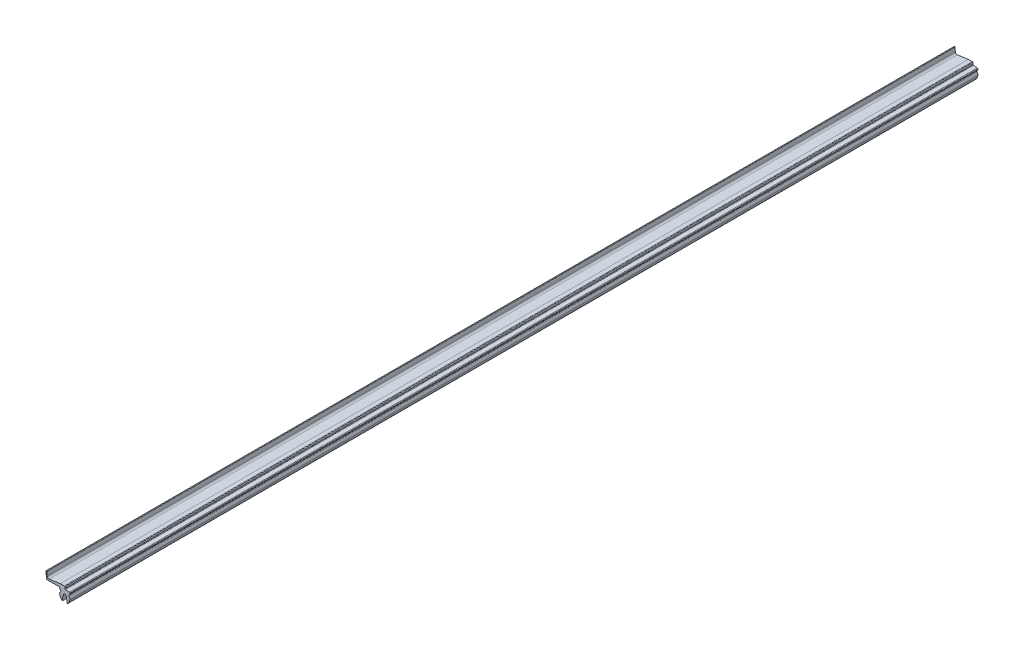
ISO-10303-21;
HEADER;
FILE_DESCRIPTION(('STEP AP214'),'2;1');
FILE_NAME('part.step','',(''),(''),'','','');
FILE_SCHEMA(('AUTOMOTIVE_DESIGN { 1 0 10303 214 1 1 1 1 }'));
ENDSEC;
DATA;
#1=APPLICATION_CONTEXT('core data for automotive mechanical design processes');
#2=APPLICATION_PROTOCOL_DEFINITION('international standard','automotive_design',2000,#1);
#3=PRODUCT_CONTEXT('',#1,'mechanical');
#4=PRODUCT('Part','Part','',(#3));
#5=PRODUCT_RELATED_PRODUCT_CATEGORY('part','',(#4));
#6=PRODUCT_DEFINITION_FORMATION('','',#4);
#7=PRODUCT_DEFINITION_CONTEXT('part definition',#1,'design');
#8=PRODUCT_DEFINITION('design','',#6,#7);
#9=PRODUCT_DEFINITION_SHAPE('','',#8);
#10=(LENGTH_UNIT() NAMED_UNIT(*) SI_UNIT(.MILLI.,.METRE.));
#11=(NAMED_UNIT(*) PLANE_ANGLE_UNIT() SI_UNIT($,.RADIAN.));
#12=(NAMED_UNIT(*) SI_UNIT($,.STERADIAN.) SOLID_ANGLE_UNIT());
#13=UNCERTAINTY_MEASURE_WITH_UNIT(LENGTH_MEASURE(1.E-05),#10,'distance_accuracy_value','');
#14=(GEOMETRIC_REPRESENTATION_CONTEXT(3) GLOBAL_UNCERTAINTY_ASSIGNED_CONTEXT((#13)) GLOBAL_UNIT_ASSIGNED_CONTEXT((#10,
#11,#12)) REPRESENTATION_CONTEXT('',''));
#15=CARTESIAN_POINT('',(0.,0.,0.));
#16=DIRECTION('',(0.,0.,1.));
#17=DIRECTION('',(1.,0.,0.));
#18=AXIS2_PLACEMENT_3D('',#15,#16,#17);
#19=CARTESIAN_POINT('',(-19.5648233753287,0.500000000161028,-1000.));
#20=DIRECTION('',(0.,0.,1.));
#21=DIRECTION('',(1.,0.,0.));
#22=AXIS2_PLACEMENT_3D('',#19,#20,#21);
#23=CYLINDRICAL_SURFACE('',#22,0.500000000160943);
#24=CARTESIAN_POINT('',(-19.5648233753287,0.500000000161028,0.));
#25=DIRECTION('',(0.,0.,1.));
#26=DIRECTION('',(1.,0.,0.));
#27=AXIS2_PLACEMENT_3D('',#24,#25,#26);
#28=CIRCLE('',#27,0.500000000160943);
#29=CARTESIAN_POINT('',(-20.0632733755824,0.460660485573406,0.));
#30=VERTEX_POINT('',#29);
#31=CARTESIAN_POINT('',(-19.5648233753287,0.,0.));
#32=VERTEX_POINT('',#31);
#33=EDGE_CURVE('E250',#30,#32,#28,.T.);
#34=ORIENTED_EDGE('',*,*,#33,.F.);
#35=DIRECTION('',(0.,0.,1.));
#36=VECTOR('',#35,1.);
#37=CARTESIAN_POINT('',(-20.0632733755824,0.460660485573406,-1000.));
#38=LINE('',#37,#36);
#39=CARTESIAN_POINT('',(-20.0632733755824,0.460660485573406,-1000.));
#40=VERTEX_POINT('',#39);
#41=EDGE_CURVE('E11',#40,#30,#38,.T.);
#42=ORIENTED_EDGE('',*,*,#41,.F.);
#43=CARTESIAN_POINT('',(-19.5648233753287,0.500000000161028,-1000.));
#44=DIRECTION('',(0.,0.,1.));
#45=DIRECTION('',(1.,0.,0.));
#46=AXIS2_PLACEMENT_3D('',#43,#44,#45);
#47=CIRCLE('',#46,0.500000000160943);
#48=CARTESIAN_POINT('',(-19.5648233753287,0.,-1000.));
#49=VERTEX_POINT('',#48);
#50=EDGE_CURVE('E350',#40,#49,#47,.T.);
#51=ORIENTED_EDGE('',*,*,#50,.T.);
#52=DIRECTION('',(0.,0.,1.));
#53=VECTOR('',#52,1.);
#54=CARTESIAN_POINT('',(-19.5648233753287,0.,-1000.));
#55=LINE('',#54,#53);
#56=EDGE_CURVE('E42',#49,#32,#55,.T.);
#57=ORIENTED_EDGE('',*,*,#56,.T.);
#58=EDGE_LOOP('',(#34,#42,#51,#57));
#59=FACE_BOUND('',#58,.T.);
#60=ADVANCED_FACE('F39',(#59),#23,.T.);
#61=CARTESIAN_POINT('',(-20.6387893149998,7.75271589489144,-1000.));
#62=DIRECTION('',(-0.996900000186591,-0.0786790291499223,0.));
#63=DIRECTION('',(0.0786790291499223,-0.996900000186591,0.));
#64=AXIS2_PLACEMENT_3D('',#61,#62,#63);
#65=PLANE('',#64);
#66=DIRECTION('',(0.0786790291499223,-0.996900000186591,0.));
#67=VECTOR('',#66,1.);
#68=CARTESIAN_POINT('',(-20.6387893149998,7.75271589489144,0.));
#69=LINE('',#68,#67);
#70=CARTESIAN_POINT('',(-20.6387893149998,7.75271589489144,0.));
#71=VERTEX_POINT('',#70);
#72=EDGE_CURVE('E347',#71,#30,#69,.T.);
#73=ORIENTED_EDGE('',*,*,#72,.F.);
#74=DIRECTION('',(0.,0.,1.));
#75=VECTOR('',#74,1.);
#76=CARTESIAN_POINT('',(-20.6387893149998,7.75271589489144,-1000.));
#77=LINE('',#76,#75);
#78=CARTESIAN_POINT('',(-20.6387893149998,7.75271589489144,-1000.));
#79=VERTEX_POINT('',#78);
#80=EDGE_CURVE('E49',#79,#71,#77,.T.);
#81=ORIENTED_EDGE('',*,*,#80,.F.);
#82=DIRECTION('',(0.0786790291499223,-0.996900000186591,0.));
#83=VECTOR('',#82,1.);
#84=CARTESIAN_POINT('',(-20.6387893149998,7.75271589489144,-1000.));
#85=LINE('',#84,#83);
#86=EDGE_CURVE('E236',#79,#40,#85,.T.);
#87=ORIENTED_EDGE('',*,*,#86,.T.);
#88=ORIENTED_EDGE('',*,*,#41,.T.);
#89=EDGE_LOOP('',(#73,#81,#87,#88));
#90=FACE_BOUND('',#89,.T.);
#91=ADVANCED_FACE('F422',(#90),#65,.T.);
#92=CARTESIAN_POINT('',(-20.1403393147461,7.79205540947906,-1000.));
#93=DIRECTION('',(0.,0.,1.));
#94=DIRECTION('',(1.,0.,0.));
#95=AXIS2_PLACEMENT_3D('',#92,#93,#94);
#96=CYLINDRICAL_SURFACE('',#95,0.500000000160938);
#97=CARTESIAN_POINT('',(-20.1403393147461,7.79205540947906,0.));
#98=DIRECTION('',(0.,0.,1.));
#99=DIRECTION('',(1.,0.,0.));
#100=AXIS2_PLACEMENT_3D('',#97,#98,#99);
#101=CIRCLE('',#100,0.500000000160938);
#102=CARTESIAN_POINT('',(-19.64231318097,7.83643975623623,0.));
#103=VERTEX_POINT('',#102);
#104=EDGE_CURVE('E222',#103,#71,#101,.T.);
#105=ORIENTED_EDGE('',*,*,#104,.F.);
#106=DIRECTION('',(0.,0.,1.));
#107=VECTOR('',#106,1.);
#108=CARTESIAN_POINT('',(-19.64231318097,7.83643975623623,-1000.));
#109=LINE('',#108,#107);
#110=CARTESIAN_POINT('',(-19.64231318097,7.83643975623623,-1000.));
#111=VERTEX_POINT('',#110);
#112=EDGE_CURVE('E217',#111,#103,#109,.T.);
#113=ORIENTED_EDGE('',*,*,#112,.F.);
#114=CARTESIAN_POINT('',(-20.1403393147461,7.79205540947906,-1000.));
#115=DIRECTION('',(0.,0.,1.));
#116=DIRECTION('',(1.,0.,0.));
#117=AXIS2_PLACEMENT_3D('',#114,#115,#116);
#118=CIRCLE('',#117,0.500000000160938);
#119=EDGE_CURVE('E220',#111,#79,#118,.T.);
#120=ORIENTED_EDGE('',*,*,#119,.T.);
#121=ORIENTED_EDGE('',*,*,#80,.T.);
#122=EDGE_LOOP('',(#105,#113,#120,#121));
#123=FACE_BOUND('',#122,.T.);
#124=ADVANCED_FACE('F219',(#123),#96,.T.);
#125=CARTESIAN_POINT('',(-19.266905517935,3.62408020447586,-1000.));
#126=DIRECTION('',(0.996052267231407,0.088768693485785,0.));
#127=DIRECTION('',(-0.088768693485785,0.996052267231407,0.));
#128=AXIS2_PLACEMENT_3D('',#125,#126,#127);
#129=PLANE('',#128);
#130=DIRECTION('',(-0.088768693485785,0.996052267231407,0.));
#131=VECTOR('',#130,1.);
#132=CARTESIAN_POINT('',(-19.266905517935,3.62408020447586,0.));
#133=LINE('',#132,#131);
#134=CARTESIAN_POINT('',(-19.266905517935,3.62408020447586,0.));
#135=VERTEX_POINT('',#134);
#136=EDGE_CURVE('E342',#135,#103,#133,.T.);
#137=ORIENTED_EDGE('',*,*,#136,.F.);
#138=DIRECTION('',(0.,0.,1.));
#139=VECTOR('',#138,1.);
#140=CARTESIAN_POINT('',(-19.266905517935,3.62408020447586,-1000.));
#141=LINE('',#140,#139);
#142=CARTESIAN_POINT('',(-19.266905517935,3.62408020447586,-1000.));
#143=VERTEX_POINT('',#142);
#144=EDGE_CURVE('E228',#143,#135,#141,.T.);
#145=ORIENTED_EDGE('',*,*,#144,.F.);
#146=DIRECTION('',(-0.088768693485785,0.996052267231407,0.));
#147=VECTOR('',#146,1.);
#148=CARTESIAN_POINT('',(-19.266905517935,3.62408020447586,-1000.));
#149=LINE('',#148,#147);
#150=EDGE_CURVE('E234',#143,#111,#149,.T.);
#151=ORIENTED_EDGE('',*,*,#150,.T.);
#152=ORIENTED_EDGE('',*,*,#112,.T.);
#153=EDGE_LOOP('',(#137,#145,#151,#152));
#154=FACE_BOUND('',#153,.T.);
#155=ADVANCED_FACE('F239',(#154),#129,.T.);
#156=CARTESIAN_POINT('',(-17.3266509834356,3.79699669261971,-1000.));
#157=DIRECTION('',(0.,0.,1.));
#158=DIRECTION('',(1.,0.,0.));
#159=AXIS2_PLACEMENT_3D('',#156,#157,#158);
#160=CYLINDRICAL_SURFACE('',#159,1.94794449882878);
#161=CARTESIAN_POINT('',(-17.3266509834356,3.79699669261971,0.));
#162=DIRECTION('',(0.,0.,-1.));
#163=DIRECTION('',(1.,0.,0.));
#164=AXIS2_PLACEMENT_3D('',#161,#162,#163);
#165=CIRCLE('',#164,1.94794449882878);
#166=CARTESIAN_POINT('',(-17.0633866473732,1.86692424323474,0.));
#167=VERTEX_POINT('',#166);
#168=EDGE_CURVE('E338',#167,#135,#165,.T.);
#169=ORIENTED_EDGE('',*,*,#168,.F.);
#170=DIRECTION('',(0.,0.,1.));
#171=VECTOR('',#170,1.);
#172=CARTESIAN_POINT('',(-17.0633866473732,1.86692424323474,-1000.));
#173=LINE('',#172,#171);
#174=CARTESIAN_POINT('',(-17.0633866473732,1.86692424323474,-1000.));
#175=VERTEX_POINT('',#174);
#176=EDGE_CURVE('E356',#175,#167,#173,.T.);
#177=ORIENTED_EDGE('',*,*,#176,.F.);
#178=CARTESIAN_POINT('',(-17.3266509834356,3.79699669261971,-1000.));
#179=DIRECTION('',(0.,0.,-1.));
#180=DIRECTION('',(1.,0.,0.));
#181=AXIS2_PLACEMENT_3D('',#178,#179,#180);
#182=CIRCLE('',#181,1.94794449882878);
#183=EDGE_CURVE('E241',#175,#143,#182,.T.);
#184=ORIENTED_EDGE('',*,*,#183,.T.);
#185=ORIENTED_EDGE('',*,*,#144,.T.);
#186=EDGE_LOOP('',(#169,#177,#184,#185));
#187=FACE_BOUND('',#186,.T.);
#188=ADVANCED_FACE('F435',(#187),#160,.F.);
#189=CARTESIAN_POINT('',(-4.92866087405882,3.52211626725921,-1000.));
#190=DIRECTION('',(-0.135149813673198,0.990825175227245,0.));
#191=DIRECTION('',(-0.990825175227245,-0.135149813673198,0.));
#192=AXIS2_PLACEMENT_3D('',#189,#190,#191);
#193=PLANE('',#192);
#194=DIRECTION('',(-0.990825175227245,-0.135149813673198,0.));
#195=VECTOR('',#194,1.);
#196=CARTESIAN_POINT('',(-4.92866087405882,3.52211626725921,0.));
#197=LINE('',#196,#195);
#198=CARTESIAN_POINT('',(-4.92866087405882,3.52211626725921,0.));
#199=VERTEX_POINT('',#198);
#200=EDGE_CURVE('E334',#199,#167,#197,.T.);
#201=ORIENTED_EDGE('',*,*,#200,.F.);
#202=DIRECTION('',(0.,0.,1.));
#203=VECTOR('',#202,1.);
#204=CARTESIAN_POINT('',(-4.92866087405882,3.52211626725921,-1000.));
#205=LINE('',#204,#203);
#206=CARTESIAN_POINT('',(-4.92866087405882,3.52211626725921,-1000.));
#207=VERTEX_POINT('',#206);
#208=EDGE_CURVE('E359',#207,#199,#205,.T.);
#209=ORIENTED_EDGE('',*,*,#208,.F.);
#210=DIRECTION('',(-0.990825175227245,-0.135149813673198,0.));
#211=VECTOR('',#210,1.);
#212=CARTESIAN_POINT('',(-4.92866087405882,3.52211626725921,-1000.));
#213=LINE('',#212,#211);
#214=EDGE_CURVE('E244',#207,#175,#213,.T.);
#215=ORIENTED_EDGE('',*,*,#214,.T.);
#216=ORIENTED_EDGE('',*,*,#176,.T.);
#217=EDGE_LOOP('',(#201,#209,#215,#216));
#218=FACE_BOUND('',#217,.T.);
#219=ADVANCED_FACE('F438',(#218),#193,.T.);
#220=CARTESIAN_POINT('',(-0.747703742875198,3.52211626725921,-1000.));
#221=DIRECTION('',(0.,1.,0.));
#222=DIRECTION('',(0.,0.,1.));
#223=AXIS2_PLACEMENT_3D('',#220,#221,#222);
#224=PLANE('',#223);
#225=DIRECTION('',(-1.,0.,0.));
#226=VECTOR('',#225,1.);
#227=CARTESIAN_POINT('',(-0.747703742875198,3.52211626725921,0.));
#228=LINE('',#227,#226);
#229=CARTESIAN_POINT('',(-0.747703742875198,3.52211626725921,0.));
#230=VERTEX_POINT('',#229);
#231=EDGE_CURVE('E330',#230,#199,#228,.T.);
#232=ORIENTED_EDGE('',*,*,#231,.F.);
#233=DIRECTION('',(0.,0.,1.));
#234=VECTOR('',#233,1.);
#235=CARTESIAN_POINT('',(-0.747703742875198,3.52211626725921,-1000.));
#236=LINE('',#235,#234);
#237=CARTESIAN_POINT('',(-0.747703742875198,3.52211626725921,-1000.));
#238=VERTEX_POINT('',#237);
#239=EDGE_CURVE('E362',#238,#230,#236,.T.);
#240=ORIENTED_EDGE('',*,*,#239,.F.);
#241=DIRECTION('',(-1.,0.,0.));
#242=VECTOR('',#241,1.);
#243=CARTESIAN_POINT('',(-0.747703742875198,3.52211626725921,-1000.));
#244=LINE('',#243,#242);
#245=EDGE_CURVE('E759',#238,#207,#244,.T.);
#246=ORIENTED_EDGE('',*,*,#245,.T.);
#247=ORIENTED_EDGE('',*,*,#208,.T.);
#248=EDGE_LOOP('',(#232,#240,#246,#247));
#249=FACE_BOUND('',#248,.T.);
#250=ADVANCED_FACE('F442',(#249),#224,.T.);
#251=CARTESIAN_POINT('',(-0.747703742875198,2.51929673228398,-1000.));
#252=DIRECTION('',(0.,0.,1.));
#253=DIRECTION('',(1.,0.,0.));
#254=AXIS2_PLACEMENT_3D('',#251,#252,#253);
#255=CYLINDRICAL_SURFACE('',#254,1.00281953497523);
#256=CARTESIAN_POINT('',(-0.747703742875198,2.51929673228398,0.));
#257=DIRECTION('',(0.,0.,1.));
#258=DIRECTION('',(1.,0.,0.));
#259=AXIS2_PLACEMENT_3D('',#256,#257,#258);
#260=CIRCLE('',#259,1.00281953497523);
#261=CARTESIAN_POINT('',(0.,3.18756773466126,0.));
#262=VERTEX_POINT('',#261);
#263=EDGE_CURVE('E326',#262,#230,#260,.T.);
#264=ORIENTED_EDGE('',*,*,#263,.F.);
#265=DIRECTION('',(0.,0.,1.));
#266=VECTOR('',#265,1.);
#267=CARTESIAN_POINT('',(0.,3.18756773466126,-1000.));
#268=LINE('',#267,#266);
#269=CARTESIAN_POINT('',(0.,3.18756773466126,-1000.));
#270=VERTEX_POINT('',#269);
#271=EDGE_CURVE('E365',#270,#262,#268,.T.);
#272=ORIENTED_EDGE('',*,*,#271,.F.);
#273=CARTESIAN_POINT('',(-0.747703742875198,2.51929673228398,-1000.));
#274=DIRECTION('',(0.,0.,1.));
#275=DIRECTION('',(1.,0.,0.));
#276=AXIS2_PLACEMENT_3D('',#273,#274,#275);
#277=CIRCLE('',#276,1.00281953497523);
#278=EDGE_CURVE('E752',#270,#238,#277,.T.);
#279=ORIENTED_EDGE('',*,*,#278,.T.);
#280=ORIENTED_EDGE('',*,*,#239,.T.);
#281=EDGE_LOOP('',(#264,#272,#279,#280));
#282=FACE_BOUND('',#281,.T.);
#283=ADVANCED_FACE('F446',(#282),#255,.T.);
#284=CARTESIAN_POINT('',(-1.09906525687861,2.20526231237195,-1000.));
#285=DIRECTION('',(0.,0.,1.));
#286=DIRECTION('',(1.,0.,0.));
#287=AXIS2_PLACEMENT_3D('',#284,#285,#286);
#288=CYLINDRICAL_SURFACE('',#287,1.47406525687861);
#289=CARTESIAN_POINT('',(-1.09906525687861,2.20526231237195,0.));
#290=DIRECTION('',(0.,0.,1.));
#291=DIRECTION('',(1.,0.,0.));
#292=AXIS2_PLACEMENT_3D('',#289,#290,#291);
#293=CIRCLE('',#292,1.47406525687861);
#294=CARTESIAN_POINT('',(0.21856094147353,1.54440712176458,0.));
#295=VERTEX_POINT('',#294);
#296=EDGE_CURVE('E322',#295,#262,#293,.T.);
#297=ORIENTED_EDGE('',*,*,#296,.F.);
#298=DIRECTION('',(0.,0.,1.));
#299=VECTOR('',#298,1.);
#300=CARTESIAN_POINT('',(0.21856094147353,1.54440712176458,-1000.));
#301=LINE('',#300,#299);
#302=CARTESIAN_POINT('',(0.21856094147353,1.54440712176458,-1000.));
#303=VERTEX_POINT('',#302);
#304=EDGE_CURVE('E368',#303,#295,#301,.T.);
#305=ORIENTED_EDGE('',*,*,#304,.F.);
#306=CARTESIAN_POINT('',(-1.09906525687861,2.20526231237195,-1000.));
#307=DIRECTION('',(0.,0.,1.));
#308=DIRECTION('',(1.,0.,0.));
#309=AXIS2_PLACEMENT_3D('',#306,#307,#308);
#310=CIRCLE('',#309,1.47406525687861);
#311=EDGE_CURVE('E748',#303,#270,#310,.T.);
#312=ORIENTED_EDGE('',*,*,#311,.T.);
#313=ORIENTED_EDGE('',*,*,#271,.T.);
#314=EDGE_LOOP('',(#297,#305,#312,#313));
#315=FACE_BOUND('',#314,.T.);
#316=ADVANCED_FACE('F450',(#315),#288,.T.);
#317=CARTESIAN_POINT('',(0.718308765862759,1.29375868736384,-1000.));
#318=DIRECTION('',(0.,0.,1.));
#319=DIRECTION('',(1.,0.,0.));
#320=AXIS2_PLACEMENT_3D('',#317,#318,#319);
#321=CYLINDRICAL_SURFACE('',#320,0.559081859524451);
#322=CARTESIAN_POINT('',(0.718308765862759,1.29375868736384,0.));
#323=DIRECTION('',(0.,0.,-1.));
#324=DIRECTION('',(1.,0.,0.));
#325=AXIS2_PLACEMENT_3D('',#322,#323,#324);
#326=CIRCLE('',#325,0.559081859524451);
#327=CARTESIAN_POINT('',(0.673438443794725,0.736480318999495,0.));
#328=VERTEX_POINT('',#327);
#329=EDGE_CURVE('E318',#328,#295,#326,.T.);
#330=ORIENTED_EDGE('',*,*,#329,.F.);
#331=DIRECTION('',(0.,0.,1.));
#332=VECTOR('',#331,1.);
#333=CARTESIAN_POINT('',(0.673438443794725,0.736480318999495,-1000.));
#334=LINE('',#333,#332);
#335=CARTESIAN_POINT('',(0.673438443794725,0.736480318999495,-1000.));
#336=VERTEX_POINT('',#335);
#337=EDGE_CURVE('E371',#336,#328,#334,.T.);
#338=ORIENTED_EDGE('',*,*,#337,.F.);
#339=CARTESIAN_POINT('',(0.718308765862759,1.29375868736384,-1000.));
#340=DIRECTION('',(0.,0.,-1.));
#341=DIRECTION('',(1.,0.,0.));
#342=AXIS2_PLACEMENT_3D('',#339,#340,#341);
#343=CIRCLE('',#342,0.559081859524451);
#344=EDGE_CURVE('E768',#336,#303,#343,.T.);
#345=ORIENTED_EDGE('',*,*,#344,.T.);
#346=ORIENTED_EDGE('',*,*,#304,.T.);
#347=EDGE_LOOP('',(#330,#338,#345,#346));
#348=FACE_BOUND('',#347,.T.);
#349=ADVANCED_FACE('F454',(#348),#321,.F.);
#350=CARTESIAN_POINT('',(5.01765090406748,0.386697834535685,-1000.));
#351=DIRECTION('',(0.0802571596692539,0.996774191239833,0.));
#352=DIRECTION('',(-0.996774191239833,0.0802571596692539,0.));
#353=AXIS2_PLACEMENT_3D('',#350,#351,#352);
#354=PLANE('',#353);
#355=DIRECTION('',(-0.996774191239833,0.0802571596692539,0.));
#356=VECTOR('',#355,1.);
#357=CARTESIAN_POINT('',(5.01765090406748,0.386697834535685,0.));
#358=LINE('',#357,#356);
#359=CARTESIAN_POINT('',(5.01765090406748,0.386697834535685,0.));
#360=VERTEX_POINT('',#359);
#361=EDGE_CURVE('E314',#360,#328,#358,.T.);
#362=ORIENTED_EDGE('',*,*,#361,.F.);
#363=DIRECTION('',(0.,0.,1.));
#364=VECTOR('',#363,1.);
#365=CARTESIAN_POINT('',(5.01765090406748,0.386697834535685,-1000.));
#366=LINE('',#365,#364);
#367=CARTESIAN_POINT('',(5.01765090406748,0.386697834535685,-1000.));
#368=VERTEX_POINT('',#367);
#369=EDGE_CURVE('E374',#368,#360,#366,.T.);
#370=ORIENTED_EDGE('',*,*,#369,.F.);
#371=DIRECTION('',(-0.996774191239833,0.0802571596692539,0.));
#372=VECTOR('',#371,1.);
#373=CARTESIAN_POINT('',(5.01765090406748,0.386697834535685,-1000.));
#374=LINE('',#373,#372);
#375=EDGE_CURVE('E741',#368,#336,#374,.T.);
#376=ORIENTED_EDGE('',*,*,#375,.T.);
#377=ORIENTED_EDGE('',*,*,#337,.T.);
#378=EDGE_LOOP('',(#362,#370,#376,#377));
#379=FACE_BOUND('',#378,.T.);
#380=ADVANCED_FACE('F458',(#379),#354,.T.);
#381=CARTESIAN_POINT('',(4.95980056539854,-0.331789148772958,-1000.));
#382=DIRECTION('',(0.,0.,1.));
#383=DIRECTION('',(1.,0.,0.));
#384=AXIS2_PLACEMENT_3D('',#381,#382,#383);
#385=CYLINDRICAL_SURFACE('',#384,0.72081218557129);
#386=CARTESIAN_POINT('',(4.95980056539854,-0.331789148772958,0.));
#387=DIRECTION('',(0.,0.,1.));
#388=DIRECTION('',(1.,0.,0.));
#389=AXIS2_PLACEMENT_3D('',#386,#387,#388);
#390=CIRCLE('',#389,0.72081218557129);
#391=CARTESIAN_POINT('',(5.67373765869524,-0.43110699048897,0.));
#392=VERTEX_POINT('',#391);
#393=EDGE_CURVE('E310',#392,#360,#390,.T.);
#394=ORIENTED_EDGE('',*,*,#393,.F.);
#395=DIRECTION('',(0.,0.,1.));
#396=VECTOR('',#395,1.);
#397=CARTESIAN_POINT('',(5.67373765869524,-0.43110699048897,-1000.));
#398=LINE('',#397,#396);
#399=CARTESIAN_POINT('',(5.67373765869524,-0.43110699048897,-1000.));
#400=VERTEX_POINT('',#399);
#401=EDGE_CURVE('E377',#400,#392,#398,.T.);
#402=ORIENTED_EDGE('',*,*,#401,.F.);
#403=CARTESIAN_POINT('',(4.95980056539854,-0.331789148772958,-1000.));
#404=DIRECTION('',(0.,0.,1.));
#405=DIRECTION('',(1.,0.,0.));
#406=AXIS2_PLACEMENT_3D('',#403,#404,#405);
#407=CIRCLE('',#406,0.72081218557129);
#408=EDGE_CURVE('E737',#400,#368,#407,.T.);
#409=ORIENTED_EDGE('',*,*,#408,.T.);
#410=ORIENTED_EDGE('',*,*,#369,.T.);
#411=EDGE_LOOP('',(#394,#402,#409,#410));
#412=FACE_BOUND('',#411,.T.);
#413=ADVANCED_FACE('F462',(#412),#385,.T.);
#414=CARTESIAN_POINT('',(1.79930884673125,0.107875941059991,-1000.));
#415=DIRECTION('',(0.,0.,1.));
#416=DIRECTION('',(1.,0.,0.));
#417=AXIS2_PLACEMENT_3D('',#414,#415,#416);
#418=CYLINDRICAL_SURFACE('',#417,3.9117388997066);
#419=CARTESIAN_POINT('',(1.79930884673125,0.107875941059991,0.));
#420=DIRECTION('',(0.,0.,1.));
#421=DIRECTION('',(1.,0.,0.));
#422=AXIS2_PLACEMENT_3D('',#419,#420,#421);
#423=CIRCLE('',#422,3.9117388997066);
#424=CARTESIAN_POINT('',(4.64331942585711,-2.57788373644244,0.));
#425=VERTEX_POINT('',#424);
#426=EDGE_CURVE('E306',#425,#392,#423,.T.);
#427=ORIENTED_EDGE('',*,*,#426,.F.);
#428=DIRECTION('',(0.,0.,1.));
#429=VECTOR('',#428,1.);
#430=CARTESIAN_POINT('',(4.64331942585711,-2.57788373644244,-1000.));
#431=LINE('',#430,#429);
#432=CARTESIAN_POINT('',(4.64331942585711,-2.57788373644244,-1000.));
#433=VERTEX_POINT('',#432);
#434=EDGE_CURVE('E380',#433,#425,#431,.T.);
#435=ORIENTED_EDGE('',*,*,#434,.F.);
#436=CARTESIAN_POINT('',(1.79930884673125,0.107875941059991,-1000.));
#437=DIRECTION('',(0.,0.,1.));
#438=DIRECTION('',(1.,0.,0.));
#439=AXIS2_PLACEMENT_3D('',#436,#437,#438);
#440=CIRCLE('',#439,3.9117388997066);
#441=EDGE_CURVE('E775',#433,#400,#440,.T.);
#442=ORIENTED_EDGE('',*,*,#441,.T.);
#443=ORIENTED_EDGE('',*,*,#401,.T.);
#444=EDGE_LOOP('',(#427,#435,#442,#443));
#445=FACE_BOUND('',#444,.T.);
#446=ADVANCED_FACE('F466',(#445),#418,.T.);
#447=CARTESIAN_POINT('',(5.37462878457498,-3.25992964590054,-1000.));
#448=DIRECTION('',(0.,0.,1.));
#449=DIRECTION('',(1.,0.,0.));
#450=AXIS2_PLACEMENT_3D('',#447,#448,#449);
#451=CYLINDRICAL_SURFACE('',#450,1.00000000037843);
#452=CARTESIAN_POINT('',(5.37462878457498,-3.25992964590054,0.));
#453=DIRECTION('',(0.,0.,-1.));
#454=DIRECTION('',(1.,0.,0.));
#455=AXIS2_PLACEMENT_3D('',#452,#453,#454);
#456=CIRCLE('',#455,1.00000000037843);
#457=CARTESIAN_POINT('',(4.74353623284226,-4.03563718866673,0.));
#458=VERTEX_POINT('',#457);
#459=EDGE_CURVE('E302',#458,#425,#456,.T.);
#460=ORIENTED_EDGE('',*,*,#459,.F.);
#461=DIRECTION('',(0.,0.,1.));
#462=VECTOR('',#461,1.);
#463=CARTESIAN_POINT('',(4.74353623284226,-4.03563718866673,-1000.));
#464=LINE('',#463,#462);
#465=CARTESIAN_POINT('',(4.74353623284226,-4.03563718866673,-1000.));
#466=VERTEX_POINT('',#465);
#467=EDGE_CURVE('E383',#466,#458,#464,.T.);
#468=ORIENTED_EDGE('',*,*,#467,.F.);
#469=CARTESIAN_POINT('',(5.37462878457498,-3.25992964590054,-1000.));
#470=DIRECTION('',(0.,0.,-1.));
#471=DIRECTION('',(1.,0.,0.));
#472=AXIS2_PLACEMENT_3D('',#469,#470,#471);
#473=CIRCLE('',#472,1.00000000037843);
#474=EDGE_CURVE('E730',#466,#433,#473,.T.);
#475=ORIENTED_EDGE('',*,*,#474,.T.);
#476=ORIENTED_EDGE('',*,*,#434,.T.);
#477=EDGE_LOOP('',(#460,#468,#475,#476));
#478=FACE_BOUND('',#477,.T.);
#479=ADVANCED_FACE('F470',(#478),#451,.F.);
#480=CARTESIAN_POINT('',(3.12636068542179,-6.02338885308883,-1000.));
#481=DIRECTION('',(0.,0.,1.));
#482=DIRECTION('',(1.,0.,0.));
#483=AXIS2_PLACEMENT_3D('',#480,#481,#482);
#484=CYLINDRICAL_SURFACE('',#483,2.56250140108987);
#485=CARTESIAN_POINT('',(3.12636068542179,-6.02338885308883,0.));
#486=DIRECTION('',(0.,0.,1.));
#487=DIRECTION('',(1.,0.,0.));
#488=AXIS2_PLACEMENT_3D('',#485,#486,#487);
#489=CIRCLE('',#488,2.56250140108987);
#490=CARTESIAN_POINT('',(5.62475183353854,-6.59299845764218,0.));
#491=VERTEX_POINT('',#490);
#492=EDGE_CURVE('E298',#491,#458,#489,.T.);
#493=ORIENTED_EDGE('',*,*,#492,.F.);
#494=DIRECTION('',(0.,0.,1.));
#495=VECTOR('',#494,1.);
#496=CARTESIAN_POINT('',(5.62475183353854,-6.59299845764218,-1000.));
#497=LINE('',#496,#495);
#498=CARTESIAN_POINT('',(5.62475183353854,-6.59299845764218,-1000.));
#499=VERTEX_POINT('',#498);
#500=EDGE_CURVE('E386',#499,#491,#497,.T.);
#501=ORIENTED_EDGE('',*,*,#500,.F.);
#502=CARTESIAN_POINT('',(3.12636068542179,-6.02338885308883,-1000.));
#503=DIRECTION('',(0.,0.,1.));
#504=DIRECTION('',(1.,0.,0.));
#505=AXIS2_PLACEMENT_3D('',#502,#503,#504);
#506=CIRCLE('',#505,2.56250140108987);
#507=EDGE_CURVE('E726',#499,#466,#506,.T.);
#508=ORIENTED_EDGE('',*,*,#507,.T.);
#509=ORIENTED_EDGE('',*,*,#467,.T.);
#510=EDGE_LOOP('',(#493,#501,#508,#509));
#511=FACE_BOUND('',#510,.T.);
#512=ADVANCED_FACE('F474',(#511),#484,.T.);
#513=CARTESIAN_POINT('',(-5.4704654323828,-4.06339362613339,-1000.));
#514=DIRECTION('',(0.,0.,1.));
#515=DIRECTION('',(1.,0.,0.));
#516=AXIS2_PLACEMENT_3D('',#513,#514,#515);
#517=CYLINDRICAL_SURFACE('',#516,11.3799273627555);
#518=CARTESIAN_POINT('',(-5.4704654323828,-4.06339362613339,0.));
#519=DIRECTION('',(0.,0.,1.));
#520=DIRECTION('',(1.,0.,0.));
#521=AXIS2_PLACEMENT_3D('',#518,#519,#520);
#522=CIRCLE('',#521,11.3799273627555);
#523=CARTESIAN_POINT('',(3.43123270033465,-11.1529999012072,0.));
#524=VERTEX_POINT('',#523);
#525=EDGE_CURVE('E294',#524,#491,#522,.T.);
#526=ORIENTED_EDGE('',*,*,#525,.F.);
#527=DIRECTION('',(0.,0.,1.));
#528=VECTOR('',#527,1.);
#529=CARTESIAN_POINT('',(3.43123270033465,-11.1529999012072,-1000.));
#530=LINE('',#529,#528);
#531=CARTESIAN_POINT('',(3.43123270033465,-11.1529999012072,-1000.));
#532=VERTEX_POINT('',#531);
#533=EDGE_CURVE('E389',#532,#524,#530,.T.);
#534=ORIENTED_EDGE('',*,*,#533,.F.);
#535=CARTESIAN_POINT('',(-5.4704654323828,-4.06339362613339,-1000.));
#536=DIRECTION('',(0.,0.,1.));
#537=DIRECTION('',(1.,0.,0.));
#538=AXIS2_PLACEMENT_3D('',#535,#536,#537);
#539=CIRCLE('',#538,11.3799273627555);
#540=EDGE_CURVE('E782',#532,#499,#539,.T.);
#541=ORIENTED_EDGE('',*,*,#540,.T.);
#542=ORIENTED_EDGE('',*,*,#500,.T.);
#543=EDGE_LOOP('',(#526,#534,#541,#542));
#544=FACE_BOUND('',#543,.T.);
#545=ADVANCED_FACE('F478',(#544),#517,.T.);
#546=CARTESIAN_POINT('',(2.51528712192112,-10.4235106033754,-1000.));
#547=DIRECTION('',(0.,0.,1.));
#548=DIRECTION('',(1.,0.,0.));
#549=AXIS2_PLACEMENT_3D('',#546,#547,#548);
#550=CYLINDRICAL_SURFACE('',#549,1.17094446421101);
#551=CARTESIAN_POINT('',(2.51528712192112,-10.4235106033754,0.));
#552=DIRECTION('',(0.,0.,1.));
#553=DIRECTION('',(1.,0.,0.));
#554=AXIS2_PLACEMENT_3D('',#551,#552,#553);
#555=CIRCLE('',#554,1.17094446421101);
#556=CARTESIAN_POINT('',(2.50692220293999,-11.5944251888157,0.));
#557=VERTEX_POINT('',#556);
#558=EDGE_CURVE('E290',#557,#524,#555,.T.);
#559=ORIENTED_EDGE('',*,*,#558,.F.);
#560=DIRECTION('',(0.,0.,1.));
#561=VECTOR('',#560,1.);
#562=CARTESIAN_POINT('',(2.50692220293999,-11.5944251888157,-1000.));
#563=LINE('',#562,#561);
#564=CARTESIAN_POINT('',(2.50692220293999,-11.5944251888157,-1000.));
#565=VERTEX_POINT('',#564);
#566=EDGE_CURVE('E392',#565,#557,#563,.T.);
#567=ORIENTED_EDGE('',*,*,#566,.F.);
#568=CARTESIAN_POINT('',(2.51528712192112,-10.4235106033754,-1000.));
#569=DIRECTION('',(0.,0.,1.));
#570=DIRECTION('',(1.,0.,0.));
#571=AXIS2_PLACEMENT_3D('',#568,#569,#570);
#572=CIRCLE('',#571,1.17094446421101);
#573=EDGE_CURVE('E719',#565,#532,#572,.T.);
#574=ORIENTED_EDGE('',*,*,#573,.T.);
#575=ORIENTED_EDGE('',*,*,#533,.T.);
#576=EDGE_LOOP('',(#559,#567,#574,#575));
#577=FACE_BOUND('',#576,.T.);
#578=ADVANCED_FACE('F482',(#577),#550,.T.);
#579=CARTESIAN_POINT('',(-18.6308141778548,-11.3809641073458,-1000.));
#580=DIRECTION('',(0.,0.,1.));
#581=DIRECTION('',(1.,0.,0.));
#582=AXIS2_PLACEMENT_3D('',#579,#580,#581);
#583=CYLINDRICAL_SURFACE('',#582,21.1388141800167);
#584=CARTESIAN_POINT('',(-18.6308141778548,-11.3809641073458,0.));
#585=DIRECTION('',(0.,0.,-1.));
#586=DIRECTION('',(1.,0.,0.));
#587=AXIS2_PLACEMENT_3D('',#584,#585,#586);
#588=CIRCLE('',#587,21.1388141800167);
#589=CARTESIAN_POINT('',(1.5838152244622,-5.19887521569609,0.));
#590=VERTEX_POINT('',#589);
#591=EDGE_CURVE('E286',#590,#557,#588,.T.);
#592=ORIENTED_EDGE('',*,*,#591,.F.);
#593=DIRECTION('',(0.,0.,1.));
#594=VECTOR('',#593,1.);
#595=CARTESIAN_POINT('',(1.5838152244622,-5.19887521569609,-1000.));
#596=LINE('',#595,#594);
#597=CARTESIAN_POINT('',(1.5838152244622,-5.19887521569609,-1000.));
#598=VERTEX_POINT('',#597);
#599=EDGE_CURVE('E395',#598,#590,#596,.T.);
#600=ORIENTED_EDGE('',*,*,#599,.F.);
#601=CARTESIAN_POINT('',(-18.6308141778548,-11.3809641073458,-1000.));
#602=DIRECTION('',(0.,0.,-1.));
#603=DIRECTION('',(1.,0.,0.));
#604=AXIS2_PLACEMENT_3D('',#601,#602,#603);
#605=CIRCLE('',#604,21.1388141800167);
#606=EDGE_CURVE('E715',#598,#565,#605,.T.);
#607=ORIENTED_EDGE('',*,*,#606,.T.);
#608=ORIENTED_EDGE('',*,*,#566,.T.);
#609=EDGE_LOOP('',(#592,#600,#607,#608));
#610=FACE_BOUND('',#609,.T.);
#611=ADVANCED_FACE('F486',(#610),#583,.F.);
#612=CARTESIAN_POINT('',(0.,-5.68324157783436,-1000.));
#613=DIRECTION('',(0.,0.,1.));
#614=DIRECTION('',(1.,0.,0.));
#615=AXIS2_PLACEMENT_3D('',#612,#613,#614);
#616=CYLINDRICAL_SURFACE('',#615,1.6562250565697);
#617=CARTESIAN_POINT('',(0.,-5.68324157783436,0.));
#618=DIRECTION('',(0.,0.,-1.));
#619=DIRECTION('',(1.,0.,0.));
#620=AXIS2_PLACEMENT_3D('',#617,#618,#619);
#621=CIRCLE('',#620,1.6562250565697);
#622=CARTESIAN_POINT('',(-1.5838152244622,-5.19887521569609,0.));
#623=VERTEX_POINT('',#622);
#624=EDGE_CURVE('E282',#623,#590,#621,.T.);
#625=ORIENTED_EDGE('',*,*,#624,.F.);
#626=DIRECTION('',(0.,0.,1.));
#627=VECTOR('',#626,1.);
#628=CARTESIAN_POINT('',(-1.5838152244622,-5.19887521569609,-1000.));
#629=LINE('',#628,#627);
#630=CARTESIAN_POINT('',(-1.5838152244622,-5.19887521569609,-1000.));
#631=VERTEX_POINT('',#630);
#632=EDGE_CURVE('E398',#631,#623,#629,.T.);
#633=ORIENTED_EDGE('',*,*,#632,.F.);
#634=CARTESIAN_POINT('',(0.,-5.68324157783436,-1000.));
#635=DIRECTION('',(0.,0.,-1.));
#636=DIRECTION('',(1.,0.,0.));
#637=AXIS2_PLACEMENT_3D('',#634,#635,#636);
#638=CIRCLE('',#637,1.6562250565697);
#639=EDGE_CURVE('E789',#631,#598,#638,.T.);
#640=ORIENTED_EDGE('',*,*,#639,.T.);
#641=ORIENTED_EDGE('',*,*,#599,.T.);
#642=EDGE_LOOP('',(#625,#633,#640,#641));
#643=FACE_BOUND('',#642,.T.);
#644=ADVANCED_FACE('F490',(#643),#616,.F.);
#645=CARTESIAN_POINT('',(18.6308141778548,-11.3809641073458,-1000.));
#646=DIRECTION('',(0.,0.,1.));
#647=DIRECTION('',(1.,0.,0.));
#648=AXIS2_PLACEMENT_3D('',#645,#646,#647);
#649=CYLINDRICAL_SURFACE('',#648,21.1388141800167);
#650=CARTESIAN_POINT('',(18.6308141778548,-11.3809641073458,0.));
#651=DIRECTION('',(0.,0.,-1.));
#652=DIRECTION('',(1.,0.,0.));
#653=AXIS2_PLACEMENT_3D('',#650,#651,#652);
#654=CIRCLE('',#653,21.1388141800167);
#655=CARTESIAN_POINT('',(-2.50692220293999,-11.5944251888157,0.));
#656=VERTEX_POINT('',#655);
#657=EDGE_CURVE('E278',#656,#623,#654,.T.);
#658=ORIENTED_EDGE('',*,*,#657,.F.);
#659=DIRECTION('',(0.,0.,1.));
#660=VECTOR('',#659,1.);
#661=CARTESIAN_POINT('',(-2.50692220293999,-11.5944251888157,-1000.));
#662=LINE('',#661,#660);
#663=CARTESIAN_POINT('',(-2.50692220293999,-11.5944251888157,-1000.));
#664=VERTEX_POINT('',#663);
#665=EDGE_CURVE('E401',#664,#656,#662,.T.);
#666=ORIENTED_EDGE('',*,*,#665,.F.);
#667=CARTESIAN_POINT('',(18.6308141778548,-11.3809641073458,-1000.));
#668=DIRECTION('',(0.,0.,-1.));
#669=DIRECTION('',(1.,0.,0.));
#670=AXIS2_PLACEMENT_3D('',#667,#668,#669);
#671=CIRCLE('',#670,21.1388141800167);
#672=EDGE_CURVE('E708',#664,#631,#671,.T.);
#673=ORIENTED_EDGE('',*,*,#672,.T.);
#674=ORIENTED_EDGE('',*,*,#632,.T.);
#675=EDGE_LOOP('',(#658,#666,#673,#674));
#676=FACE_BOUND('',#675,.T.);
#677=ADVANCED_FACE('F494',(#676),#649,.F.);
#678=CARTESIAN_POINT('',(-2.51528712192112,-10.4235106033754,-1000.));
#679=DIRECTION('',(0.,0.,1.));
#680=DIRECTION('',(1.,0.,0.));
#681=AXIS2_PLACEMENT_3D('',#678,#679,#680);
#682=CYLINDRICAL_SURFACE('',#681,1.17094446421101);
#683=CARTESIAN_POINT('',(-2.51528712192112,-10.4235106033754,0.));
#684=DIRECTION('',(0.,0.,1.));
#685=DIRECTION('',(1.,0.,0.));
#686=AXIS2_PLACEMENT_3D('',#683,#684,#685);
#687=CIRCLE('',#686,1.17094446421101);
#688=CARTESIAN_POINT('',(-3.43123270033465,-11.1529999012072,0.));
#689=VERTEX_POINT('',#688);
#690=EDGE_CURVE('E274',#689,#656,#687,.T.);
#691=ORIENTED_EDGE('',*,*,#690,.F.);
#692=DIRECTION('',(0.,0.,1.));
#693=VECTOR('',#692,1.);
#694=CARTESIAN_POINT('',(-3.43123270033465,-11.1529999012072,-1000.));
#695=LINE('',#694,#693);
#696=CARTESIAN_POINT('',(-3.43123270033465,-11.1529999012072,-1000.));
#697=VERTEX_POINT('',#696);
#698=EDGE_CURVE('E404',#697,#689,#695,.T.);
#699=ORIENTED_EDGE('',*,*,#698,.F.);
#700=CARTESIAN_POINT('',(-2.51528712192112,-10.4235106033754,-1000.));
#701=DIRECTION('',(0.,0.,1.));
#702=DIRECTION('',(1.,0.,0.));
#703=AXIS2_PLACEMENT_3D('',#700,#701,#702);
#704=CIRCLE('',#703,1.17094446421101);
#705=EDGE_CURVE('E704',#697,#664,#704,.T.);
#706=ORIENTED_EDGE('',*,*,#705,.T.);
#707=ORIENTED_EDGE('',*,*,#665,.T.);
#708=EDGE_LOOP('',(#691,#699,#706,#707));
#709=FACE_BOUND('',#708,.T.);
#710=ADVANCED_FACE('F498',(#709),#682,.T.);
#711=CARTESIAN_POINT('',(5.4704654323828,-4.06339362613339,-1000.));
#712=DIRECTION('',(0.,0.,1.));
#713=DIRECTION('',(1.,0.,0.));
#714=AXIS2_PLACEMENT_3D('',#711,#712,#713);
#715=CYLINDRICAL_SURFACE('',#714,11.3799273627555);
#716=CARTESIAN_POINT('',(5.4704654323828,-4.06339362613339,0.));
#717=DIRECTION('',(0.,0.,1.));
#718=DIRECTION('',(1.,0.,0.));
#719=AXIS2_PLACEMENT_3D('',#716,#717,#718);
#720=CIRCLE('',#719,11.3799273627555);
#721=CARTESIAN_POINT('',(-5.62475183353854,-6.59299845764217,0.));
#722=VERTEX_POINT('',#721);
#723=EDGE_CURVE('E270',#722,#689,#720,.T.);
#724=ORIENTED_EDGE('',*,*,#723,.F.);
#725=DIRECTION('',(0.,0.,1.));
#726=VECTOR('',#725,1.);
#727=CARTESIAN_POINT('',(-5.62475183353854,-6.59299845764217,-1000.));
#728=LINE('',#727,#726);
#729=CARTESIAN_POINT('',(-5.62475183353854,-6.59299845764217,-1000.));
#730=VERTEX_POINT('',#729);
#731=EDGE_CURVE('E407',#730,#722,#728,.T.);
#732=ORIENTED_EDGE('',*,*,#731,.F.);
#733=CARTESIAN_POINT('',(5.4704654323828,-4.06339362613339,-1000.));
#734=DIRECTION('',(0.,0.,1.));
#735=DIRECTION('',(1.,0.,0.));
#736=AXIS2_PLACEMENT_3D('',#733,#734,#735);
#737=CIRCLE('',#736,11.3799273627555);
#738=EDGE_CURVE('E796',#730,#697,#737,.T.);
#739=ORIENTED_EDGE('',*,*,#738,.T.);
#740=ORIENTED_EDGE('',*,*,#698,.T.);
#741=EDGE_LOOP('',(#724,#732,#739,#740));
#742=FACE_BOUND('',#741,.T.);
#743=ADVANCED_FACE('F502',(#742),#715,.T.);
#744=CARTESIAN_POINT('',(-3.12636068542179,-6.02338885308883,-1000.));
#745=DIRECTION('',(0.,0.,1.));
#746=DIRECTION('',(1.,0.,0.));
#747=AXIS2_PLACEMENT_3D('',#744,#745,#746);
#748=CYLINDRICAL_SURFACE('',#747,2.56250140108987);
#749=CARTESIAN_POINT('',(-3.12636068542179,-6.02338885308883,0.));
#750=DIRECTION('',(0.,0.,1.));
#751=DIRECTION('',(1.,0.,0.));
#752=AXIS2_PLACEMENT_3D('',#749,#750,#751);
#753=CIRCLE('',#752,2.56250140108987);
#754=CARTESIAN_POINT('',(-4.74353623284226,-4.03563718866672,0.));
#755=VERTEX_POINT('',#754);
#756=EDGE_CURVE('E266',#755,#722,#753,.T.);
#757=ORIENTED_EDGE('',*,*,#756,.F.);
#758=DIRECTION('',(0.,0.,1.));
#759=VECTOR('',#758,1.);
#760=CARTESIAN_POINT('',(-4.74353623284226,-4.03563718866672,-1000.));
#761=LINE('',#760,#759);
#762=CARTESIAN_POINT('',(-4.74353623284226,-4.03563718866672,-1000.));
#763=VERTEX_POINT('',#762);
#764=EDGE_CURVE('E410',#763,#755,#761,.T.);
#765=ORIENTED_EDGE('',*,*,#764,.F.);
#766=CARTESIAN_POINT('',(-3.12636068542179,-6.02338885308883,-1000.));
#767=DIRECTION('',(0.,0.,1.));
#768=DIRECTION('',(1.,0.,0.));
#769=AXIS2_PLACEMENT_3D('',#766,#767,#768);
#770=CIRCLE('',#769,2.56250140108987);
#771=EDGE_CURVE('E697',#763,#730,#770,.T.);
#772=ORIENTED_EDGE('',*,*,#771,.T.);
#773=ORIENTED_EDGE('',*,*,#731,.T.);
#774=EDGE_LOOP('',(#757,#765,#772,#773));
#775=FACE_BOUND('',#774,.T.);
#776=ADVANCED_FACE('F506',(#775),#748,.T.);
#777=CARTESIAN_POINT('',(-5.37462878457497,-3.25992964590054,-1000.));
#778=DIRECTION('',(0.,0.,1.));
#779=DIRECTION('',(1.,0.,0.));
#780=AXIS2_PLACEMENT_3D('',#777,#778,#779);
#781=CYLINDRICAL_SURFACE('',#780,1.00000000037843);
#782=CARTESIAN_POINT('',(-5.37462878457497,-3.25992964590054,0.));
#783=DIRECTION('',(0.,0.,-1.));
#784=DIRECTION('',(1.,0.,0.));
#785=AXIS2_PLACEMENT_3D('',#782,#783,#784);
#786=CIRCLE('',#785,1.00000000037843);
#787=CARTESIAN_POINT('',(-4.64331942585814,-2.57788373644134,0.));
#788=VERTEX_POINT('',#787);
#789=EDGE_CURVE('E262',#788,#755,#786,.T.);
#790=ORIENTED_EDGE('',*,*,#789,.F.);
#791=DIRECTION('',(0.,0.,1.));
#792=VECTOR('',#791,1.);
#793=CARTESIAN_POINT('',(-4.64331942585814,-2.57788373644134,-1000.));
#794=LINE('',#793,#792);
#795=CARTESIAN_POINT('',(-4.64331942585814,-2.57788373644134,-1000.));
#796=VERTEX_POINT('',#795);
#797=EDGE_CURVE('E413',#796,#788,#794,.T.);
#798=ORIENTED_EDGE('',*,*,#797,.F.);
#799=CARTESIAN_POINT('',(-5.37462878457497,-3.25992964590054,-1000.));
#800=DIRECTION('',(0.,0.,-1.));
#801=DIRECTION('',(1.,0.,0.));
#802=AXIS2_PLACEMENT_3D('',#799,#800,#801);
#803=CIRCLE('',#802,1.00000000037843);
#804=EDGE_CURVE('E693',#796,#763,#803,.T.);
#805=ORIENTED_EDGE('',*,*,#804,.T.);
#806=ORIENTED_EDGE('',*,*,#764,.T.);
#807=EDGE_LOOP('',(#790,#798,#805,#806));
#808=FACE_BOUND('',#807,.T.);
#809=ADVANCED_FACE('F510',(#808),#781,.F.);
#810=CARTESIAN_POINT('',(-1.79930884673125,0.107875941059991,-1000.));
#811=DIRECTION('',(0.,0.,1.));
#812=DIRECTION('',(1.,0.,0.));
#813=AXIS2_PLACEMENT_3D('',#810,#811,#812);
#814=CYLINDRICAL_SURFACE('',#813,3.91173889970659);
#815=CARTESIAN_POINT('',(-1.79930884673125,0.107875941059991,0.));
#816=DIRECTION('',(0.,0.,1.));
#817=DIRECTION('',(1.,0.,0.));
#818=AXIS2_PLACEMENT_3D('',#815,#816,#817);
#819=CIRCLE('',#818,3.91173889970659);
#820=CARTESIAN_POINT('',(-5.70955998966544,0.,0.));
#821=VERTEX_POINT('',#820);
#822=EDGE_CURVE('E258',#821,#788,#819,.T.);
#823=ORIENTED_EDGE('',*,*,#822,.F.);
#824=DIRECTION('',(0.,0.,1.));
#825=VECTOR('',#824,1.);
#826=CARTESIAN_POINT('',(-5.70955998966544,0.,-1000.));
#827=LINE('',#826,#825);
#828=CARTESIAN_POINT('',(-5.70955998966544,0.,-1000.));
#829=VERTEX_POINT('',#828);
#830=EDGE_CURVE('E415',#829,#821,#827,.T.);
#831=ORIENTED_EDGE('',*,*,#830,.F.);
#832=CARTESIAN_POINT('',(-1.79930884673125,0.107875941059991,-1000.));
#833=DIRECTION('',(0.,0.,1.));
#834=DIRECTION('',(1.,0.,0.));
#835=AXIS2_PLACEMENT_3D('',#832,#833,#834);
#836=CIRCLE('',#835,3.91173889970659);
#837=EDGE_CURVE('E803',#829,#796,#836,.T.);
#838=ORIENTED_EDGE('',*,*,#837,.T.);
#839=ORIENTED_EDGE('',*,*,#797,.T.);
#840=EDGE_LOOP('',(#823,#831,#838,#839));
#841=FACE_BOUND('',#840,.T.);
#842=ADVANCED_FACE('F514',(#841),#814,.T.);
#843=CARTESIAN_POINT('',(-19.5648233753287,0.,-1000.));
#844=DIRECTION('',(0.,-1.,0.));
#845=DIRECTION('',(1.,0.,0.));
#846=AXIS2_PLACEMENT_3D('',#843,#844,#845);
#847=PLANE('',#846);
#848=DIRECTION('',(1.,0.,0.));
#849=VECTOR('',#848,1.);
#850=CARTESIAN_POINT('',(-19.5648233753287,0.,0.));
#851=LINE('',#850,#849);
#852=EDGE_CURVE('E254',#32,#821,#851,.T.);
#853=ORIENTED_EDGE('',*,*,#852,.F.);
#854=ORIENTED_EDGE('',*,*,#56,.F.);
#855=DIRECTION('',(1.,0.,0.));
#856=VECTOR('',#855,1.);
#857=CARTESIAN_POINT('',(-19.5648233753287,0.,-1000.));
#858=LINE('',#857,#856);
#859=EDGE_CURVE('E806',#49,#829,#858,.T.);
#860=ORIENTED_EDGE('',*,*,#859,.T.);
#861=ORIENTED_EDGE('',*,*,#830,.T.);
#862=EDGE_LOOP('',(#853,#854,#860,#861));
#863=FACE_BOUND('',#862,.T.);
#864=ADVANCED_FACE('F419',(#863),#847,.T.);
#865=CARTESIAN_POINT('',(-19.5648233753287,0.500000000161028,-1000.));
#866=DIRECTION('',(0.,0.,1.));
#867=DIRECTION('',(1.,0.,0.));
#868=AXIS2_PLACEMENT_3D('',#865,#866,#867);
#869=PLANE('',#868);
#870=ORIENTED_EDGE('',*,*,#50,.F.);
#871=ORIENTED_EDGE('',*,*,#86,.F.);
#872=ORIENTED_EDGE('',*,*,#119,.F.);
#873=ORIENTED_EDGE('',*,*,#150,.F.);
#874=ORIENTED_EDGE('',*,*,#183,.F.);
#875=ORIENTED_EDGE('',*,*,#214,.F.);
#876=ORIENTED_EDGE('',*,*,#245,.F.);
#877=ORIENTED_EDGE('',*,*,#278,.F.);
#878=ORIENTED_EDGE('',*,*,#311,.F.);
#879=ORIENTED_EDGE('',*,*,#344,.F.);
#880=ORIENTED_EDGE('',*,*,#375,.F.);
#881=ORIENTED_EDGE('',*,*,#408,.F.);
#882=ORIENTED_EDGE('',*,*,#441,.F.);
#883=ORIENTED_EDGE('',*,*,#474,.F.);
#884=ORIENTED_EDGE('',*,*,#507,.F.);
#885=ORIENTED_EDGE('',*,*,#540,.F.);
#886=ORIENTED_EDGE('',*,*,#573,.F.);
#887=ORIENTED_EDGE('',*,*,#606,.F.);
#888=ORIENTED_EDGE('',*,*,#639,.F.);
#889=ORIENTED_EDGE('',*,*,#672,.F.);
#890=ORIENTED_EDGE('',*,*,#705,.F.);
#891=ORIENTED_EDGE('',*,*,#738,.F.);
#892=ORIENTED_EDGE('',*,*,#771,.F.);
#893=ORIENTED_EDGE('',*,*,#804,.F.);
#894=ORIENTED_EDGE('',*,*,#837,.F.);
#895=ORIENTED_EDGE('',*,*,#859,.F.);
#896=EDGE_LOOP('',(#870,#871,#872,#873,#874,#875,#876,#877,#878,#879,#880,#881,#882,#883,#884,
#885,#886,#887,#888,#889,#890,#891,#892,#893,#894,#895));
#897=FACE_BOUND('',#896,.T.);
#898=ADVANCED_FACE('F232',(#897),#869,.F.);
#899=CARTESIAN_POINT('',(-19.5648233753287,0.500000000161028,0.));
#900=DIRECTION('',(0.,0.,1.));
#901=DIRECTION('',(1.,0.,0.));
#902=AXIS2_PLACEMENT_3D('',#899,#900,#901);
#903=PLANE('',#902);
#904=ORIENTED_EDGE('',*,*,#33,.T.);
#905=ORIENTED_EDGE('',*,*,#852,.T.);
#906=ORIENTED_EDGE('',*,*,#822,.T.);
#907=ORIENTED_EDGE('',*,*,#789,.T.);
#908=ORIENTED_EDGE('',*,*,#756,.T.);
#909=ORIENTED_EDGE('',*,*,#723,.T.);
#910=ORIENTED_EDGE('',*,*,#690,.T.);
#911=ORIENTED_EDGE('',*,*,#657,.T.);
#912=ORIENTED_EDGE('',*,*,#624,.T.);
#913=ORIENTED_EDGE('',*,*,#591,.T.);
#914=ORIENTED_EDGE('',*,*,#558,.T.);
#915=ORIENTED_EDGE('',*,*,#525,.T.);
#916=ORIENTED_EDGE('',*,*,#492,.T.);
#917=ORIENTED_EDGE('',*,*,#459,.T.);
#918=ORIENTED_EDGE('',*,*,#426,.T.);
#919=ORIENTED_EDGE('',*,*,#393,.T.);
#920=ORIENTED_EDGE('',*,*,#361,.T.);
#921=ORIENTED_EDGE('',*,*,#329,.T.);
#922=ORIENTED_EDGE('',*,*,#296,.T.);
#923=ORIENTED_EDGE('',*,*,#263,.T.);
#924=ORIENTED_EDGE('',*,*,#231,.T.);
#925=ORIENTED_EDGE('',*,*,#200,.T.);
#926=ORIENTED_EDGE('',*,*,#168,.T.);
#927=ORIENTED_EDGE('',*,*,#136,.T.);
#928=ORIENTED_EDGE('',*,*,#104,.T.);
#929=ORIENTED_EDGE('',*,*,#72,.T.);
#930=EDGE_LOOP('',(#904,#905,#906,#907,#908,#909,#910,#911,#912,#913,#914,#915,#916,#917,#918,
#919,#920,#921,#922,#923,#924,#925,#926,#927,#928,#929));
#931=FACE_BOUND('',#930,.T.);
#932=ADVANCED_FACE('F421',(#931),#903,.T.);
#933=CLOSED_SHELL('',(#60,#91,#124,#155,#188,#219,#250,#283,#316,#349,#380,#413,#446,#479,#512,
#545,#578,#611,#644,#677,#710,#743,#776,#809,#842,#864,#898,#932));
#934=MANIFOLD_SOLID_BREP('B2',#933);
#935=ADVANCED_BREP_SHAPE_REPRESENTATION('',(#18,#934),#14);
#936=SHAPE_DEFINITION_REPRESENTATION(#9,#935);
ENDSEC;
END-ISO-10303-21;
